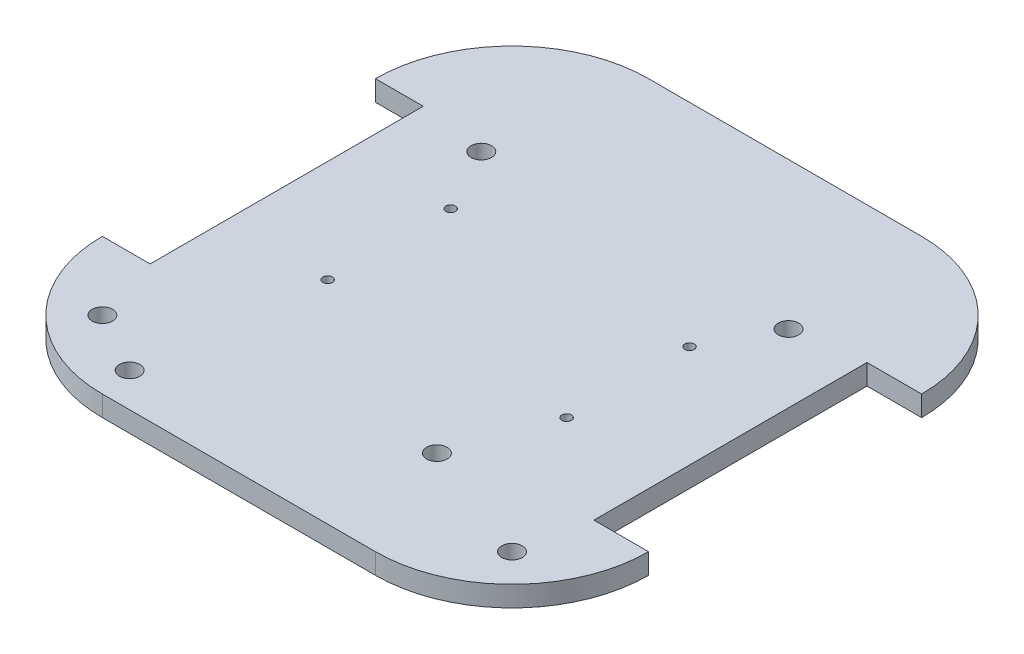
ISO-10303-21;
HEADER;
FILE_DESCRIPTION(('STEP AP214'),'2;1');
FILE_NAME('part.step','',(''),(''),'','','');
FILE_SCHEMA(('AUTOMOTIVE_DESIGN { 1 0 10303 214 1 1 1 1 }'));
ENDSEC;
DATA;
#1=APPLICATION_CONTEXT('core data for automotive mechanical design processes');
#2=APPLICATION_PROTOCOL_DEFINITION('international standard','automotive_design',2000,#1);
#3=PRODUCT_CONTEXT('',#1,'mechanical');
#4=PRODUCT('Part','Part','',(#3));
#5=PRODUCT_RELATED_PRODUCT_CATEGORY('part','',(#4));
#6=PRODUCT_DEFINITION_FORMATION('','',#4);
#7=PRODUCT_DEFINITION_CONTEXT('part definition',#1,'design');
#8=PRODUCT_DEFINITION('design','',#6,#7);
#9=PRODUCT_DEFINITION_SHAPE('','',#8);
#10=(LENGTH_UNIT() NAMED_UNIT(*) SI_UNIT(.MILLI.,.METRE.));
#11=(NAMED_UNIT(*) PLANE_ANGLE_UNIT() SI_UNIT($,.RADIAN.));
#12=(NAMED_UNIT(*) SI_UNIT($,.STERADIAN.) SOLID_ANGLE_UNIT());
#13=UNCERTAINTY_MEASURE_WITH_UNIT(LENGTH_MEASURE(1.E-05),#10,'distance_accuracy_value','');
#14=(GEOMETRIC_REPRESENTATION_CONTEXT(3) GLOBAL_UNCERTAINTY_ASSIGNED_CONTEXT((#13)) GLOBAL_UNIT_ASSIGNED_CONTEXT((#10,
#11,#12)) REPRESENTATION_CONTEXT('',''));
#15=CARTESIAN_POINT('',(0.,0.,0.));
#16=DIRECTION('',(0.,0.,1.));
#17=DIRECTION('',(1.,0.,0.));
#18=AXIS2_PLACEMENT_3D('',#15,#16,#17);
#19=CARTESIAN_POINT('',(20.,3.,-20.));
#20=DIRECTION('',(0.,-1.,0.));
#21=DIRECTION('',(0.,0.,-1.));
#22=AXIS2_PLACEMENT_3D('',#19,#20,#21);
#23=CYLINDRICAL_SURFACE('',#22,20.);
#24=DIRECTION('',(0.,-1.,0.));
#25=VECTOR('',#24,1.);
#26=CARTESIAN_POINT('',(20.,3.,0.));
#27=LINE('',#26,#25);
#28=CARTESIAN_POINT('',(20.,3.,0.));
#29=VERTEX_POINT('',#28);
#30=CARTESIAN_POINT('',(20.,0.,0.));
#31=VERTEX_POINT('',#30);
#32=EDGE_CURVE('E220',#29,#31,#27,.T.);
#33=ORIENTED_EDGE('',*,*,#32,.F.);
#34=CARTESIAN_POINT('',(20.,3.,-20.));
#35=DIRECTION('',(0.,-1.,0.));
#36=DIRECTION('',(0.,0.,-1.));
#37=AXIS2_PLACEMENT_3D('',#34,#35,#36);
#38=CIRCLE('',#37,20.);
#39=CARTESIAN_POINT('',(0.,3.,-20.));
#40=VERTEX_POINT('',#39);
#41=EDGE_CURVE('E40',#40,#29,#38,.F.);
#42=ORIENTED_EDGE('',*,*,#41,.F.);
#43=DIRECTION('',(0.,1.,0.));
#44=VECTOR('',#43,1.);
#45=CARTESIAN_POINT('',(0.,0.,-20.));
#46=LINE('',#45,#44);
#47=CARTESIAN_POINT('',(0.,0.,-20.));
#48=VERTEX_POINT('',#47);
#49=EDGE_CURVE('E173',#48,#40,#46,.T.);
#50=ORIENTED_EDGE('',*,*,#49,.F.);
#51=CARTESIAN_POINT('',(20.,0.,-20.));
#52=DIRECTION('',(0.,-1.,0.));
#53=DIRECTION('',(0.,0.,-1.));
#54=AXIS2_PLACEMENT_3D('',#51,#52,#53);
#55=CIRCLE('',#54,20.);
#56=EDGE_CURVE('E11',#31,#48,#55,.T.);
#57=ORIENTED_EDGE('',*,*,#56,.F.);
#58=EDGE_LOOP('',(#33,#42,#50,#57));
#59=FACE_BOUND('',#58,.T.);
#60=ADVANCED_FACE('F33',(#59),#23,.T.);
#61=CARTESIAN_POINT('',(60.,3.,-20.));
#62=DIRECTION('',(0.,-1.,0.));
#63=DIRECTION('',(0.,0.,-1.));
#64=AXIS2_PLACEMENT_3D('',#61,#62,#63);
#65=CYLINDRICAL_SURFACE('',#64,20.);
#66=DIRECTION('',(0.,1.,0.));
#67=VECTOR('',#66,1.);
#68=CARTESIAN_POINT('',(80.,0.,-20.));
#69=LINE('',#68,#67);
#70=CARTESIAN_POINT('',(80.,0.,-20.));
#71=VERTEX_POINT('',#70);
#72=CARTESIAN_POINT('',(80.,3.,-20.));
#73=VERTEX_POINT('',#72);
#74=EDGE_CURVE('E129',#71,#73,#69,.T.);
#75=ORIENTED_EDGE('',*,*,#74,.T.);
#76=CARTESIAN_POINT('',(60.,3.,-20.));
#77=DIRECTION('',(0.,-1.,0.));
#78=DIRECTION('',(0.,0.,-1.));
#79=AXIS2_PLACEMENT_3D('',#76,#77,#78);
#80=CIRCLE('',#79,20.);
#81=CARTESIAN_POINT('',(60.,3.,0.));
#82=VERTEX_POINT('',#81);
#83=EDGE_CURVE('E216',#82,#73,#80,.F.);
#84=ORIENTED_EDGE('',*,*,#83,.F.);
#85=DIRECTION('',(0.,-1.,0.));
#86=VECTOR('',#85,1.);
#87=CARTESIAN_POINT('',(60.,3.,0.));
#88=LINE('',#87,#86);
#89=CARTESIAN_POINT('',(60.,0.,0.));
#90=VERTEX_POINT('',#89);
#91=EDGE_CURVE('E213',#90,#82,#88,.F.);
#92=ORIENTED_EDGE('',*,*,#91,.F.);
#93=CARTESIAN_POINT('',(60.,0.,-20.));
#94=DIRECTION('',(0.,-1.,0.));
#95=DIRECTION('',(0.,0.,-1.));
#96=AXIS2_PLACEMENT_3D('',#93,#94,#95);
#97=CIRCLE('',#96,20.);
#98=EDGE_CURVE('E218',#71,#90,#97,.T.);
#99=ORIENTED_EDGE('',*,*,#98,.F.);
#100=EDGE_LOOP('',(#75,#84,#92,#99));
#101=FACE_BOUND('',#100,.T.);
#102=ADVANCED_FACE('F228',(#101),#65,.T.);
#103=CARTESIAN_POINT('',(60.,3.,-60.));
#104=DIRECTION('',(0.,1.,0.));
#105=DIRECTION('',(0.,0.,1.));
#106=AXIS2_PLACEMENT_3D('',#103,#104,#105);
#107=CYLINDRICAL_SURFACE('',#106,20.);
#108=DIRECTION('',(0.,1.,0.));
#109=VECTOR('',#108,1.);
#110=CARTESIAN_POINT('',(80.,0.,-60.));
#111=LINE('',#110,#109);
#112=CARTESIAN_POINT('',(80.,0.,-60.));
#113=VERTEX_POINT('',#112);
#114=CARTESIAN_POINT('',(80.,3.,-60.));
#115=VERTEX_POINT('',#114);
#116=EDGE_CURVE('E159',#113,#115,#111,.T.);
#117=ORIENTED_EDGE('',*,*,#116,.F.);
#118=CARTESIAN_POINT('',(60.,0.,-60.));
#119=DIRECTION('',(0.,-1.,0.));
#120=DIRECTION('',(0.,0.,-1.));
#121=AXIS2_PLACEMENT_3D('',#118,#119,#120);
#122=CIRCLE('',#121,20.);
#123=CARTESIAN_POINT('',(60.,0.,-80.));
#124=VERTEX_POINT('',#123);
#125=EDGE_CURVE('E209',#124,#113,#122,.T.);
#126=ORIENTED_EDGE('',*,*,#125,.F.);
#127=DIRECTION('',(0.,1.,0.));
#128=VECTOR('',#127,1.);
#129=CARTESIAN_POINT('',(60.,3.,-80.));
#130=LINE('',#129,#128);
#131=CARTESIAN_POINT('',(60.,3.,-80.));
#132=VERTEX_POINT('',#131);
#133=EDGE_CURVE('E206',#132,#124,#130,.F.);
#134=ORIENTED_EDGE('',*,*,#133,.F.);
#135=CARTESIAN_POINT('',(60.,3.,-60.));
#136=DIRECTION('',(0.,-1.,0.));
#137=DIRECTION('',(0.,0.,-1.));
#138=AXIS2_PLACEMENT_3D('',#135,#136,#137);
#139=CIRCLE('',#138,20.);
#140=EDGE_CURVE('E211',#115,#132,#139,.F.);
#141=ORIENTED_EDGE('',*,*,#140,.F.);
#142=EDGE_LOOP('',(#117,#126,#134,#141));
#143=FACE_BOUND('',#142,.T.);
#144=ADVANCED_FACE('F236',(#143),#107,.T.);
#145=CARTESIAN_POINT('',(20.,3.,-60.));
#146=DIRECTION('',(0.,-1.,0.));
#147=DIRECTION('',(0.,0.,-1.));
#148=AXIS2_PLACEMENT_3D('',#145,#146,#147);
#149=CYLINDRICAL_SURFACE('',#148,20.);
#150=DIRECTION('',(0.,1.,0.));
#151=VECTOR('',#150,1.);
#152=CARTESIAN_POINT('',(0.,0.,-60.));
#153=LINE('',#152,#151);
#154=CARTESIAN_POINT('',(0.,0.,-60.));
#155=VERTEX_POINT('',#154);
#156=CARTESIAN_POINT('',(0.,3.,-60.));
#157=VERTEX_POINT('',#156);
#158=EDGE_CURVE('E181',#155,#157,#153,.T.);
#159=ORIENTED_EDGE('',*,*,#158,.T.);
#160=CARTESIAN_POINT('',(20.,3.,-60.));
#161=DIRECTION('',(0.,-1.,0.));
#162=DIRECTION('',(0.,0.,-1.));
#163=AXIS2_PLACEMENT_3D('',#160,#161,#162);
#164=CIRCLE('',#163,20.);
#165=CARTESIAN_POINT('',(20.,3.,-80.));
#166=VERTEX_POINT('',#165);
#167=EDGE_CURVE('E201',#166,#157,#164,.F.);
#168=ORIENTED_EDGE('',*,*,#167,.F.);
#169=DIRECTION('',(0.,-1.,0.));
#170=VECTOR('',#169,1.);
#171=CARTESIAN_POINT('',(20.,3.,-80.));
#172=LINE('',#171,#170);
#173=CARTESIAN_POINT('',(20.,0.,-80.));
#174=VERTEX_POINT('',#173);
#175=EDGE_CURVE('E196',#174,#166,#172,.F.);
#176=ORIENTED_EDGE('',*,*,#175,.F.);
#177=CARTESIAN_POINT('',(20.,0.,-60.));
#178=DIRECTION('',(0.,-1.,0.));
#179=DIRECTION('',(0.,0.,-1.));
#180=AXIS2_PLACEMENT_3D('',#177,#178,#179);
#181=CIRCLE('',#180,20.);
#182=EDGE_CURVE('E203',#155,#174,#181,.T.);
#183=ORIENTED_EDGE('',*,*,#182,.F.);
#184=EDGE_LOOP('',(#159,#168,#176,#183));
#185=FACE_BOUND('',#184,.T.);
#186=ADVANCED_FACE('F245',(#185),#149,.T.);
#187=CARTESIAN_POINT('',(0.,3.,0.));
#188=DIRECTION('',(0.,0.,-1.));
#189=DIRECTION('',(-1.,0.,0.));
#190=AXIS2_PLACEMENT_3D('',#187,#188,#189);
#191=PLANE('',#190);
#192=DIRECTION('',(1.,0.,0.));
#193=VECTOR('',#192,1.);
#194=CARTESIAN_POINT('',(0.,3.,0.));
#195=LINE('',#194,#193);
#196=EDGE_CURVE('E191',#29,#82,#195,.T.);
#197=ORIENTED_EDGE('',*,*,#196,.F.);
#198=ORIENTED_EDGE('',*,*,#32,.T.);
#199=DIRECTION('',(1.,0.,0.));
#200=VECTOR('',#199,1.);
#201=CARTESIAN_POINT('',(0.,0.,0.));
#202=LINE('',#201,#200);
#203=EDGE_CURVE('E184',#31,#90,#202,.T.);
#204=ORIENTED_EDGE('',*,*,#203,.T.);
#205=ORIENTED_EDGE('',*,*,#91,.T.);
#206=EDGE_LOOP('',(#197,#198,#204,#205));
#207=FACE_BOUND('',#206,.T.);
#208=ADVANCED_FACE('F223',(#207),#191,.F.);
#209=CARTESIAN_POINT('',(0.,3.,-80.));
#210=DIRECTION('',(0.,0.,1.));
#211=DIRECTION('',(1.,0.,0.));
#212=AXIS2_PLACEMENT_3D('',#209,#210,#211);
#213=PLANE('',#212);
#214=DIRECTION('',(-1.,0.,0.));
#215=VECTOR('',#214,1.);
#216=CARTESIAN_POINT('',(0.,3.,-80.));
#217=LINE('',#216,#215);
#218=EDGE_CURVE('E193',#132,#166,#217,.T.);
#219=ORIENTED_EDGE('',*,*,#218,.F.);
#220=ORIENTED_EDGE('',*,*,#133,.T.);
#221=DIRECTION('',(-1.,0.,0.));
#222=VECTOR('',#221,1.);
#223=CARTESIAN_POINT('',(0.,0.,-80.));
#224=LINE('',#223,#222);
#225=EDGE_CURVE('E194',#124,#174,#224,.T.);
#226=ORIENTED_EDGE('',*,*,#225,.T.);
#227=ORIENTED_EDGE('',*,*,#175,.T.);
#228=EDGE_LOOP('',(#219,#220,#226,#227));
#229=FACE_BOUND('',#228,.T.);
#230=ADVANCED_FACE('F240',(#229),#213,.F.);
#231=CARTESIAN_POINT('',(0.,3.,0.));
#232=DIRECTION('',(0.,-1.,0.));
#233=DIRECTION('',(0.,0.,-1.));
#234=AXIS2_PLACEMENT_3D('',#231,#232,#233);
#235=PLANE('',#234);
#236=CARTESIAN_POINT('',(57.,3.,-31.));
#237=DIRECTION('',(0.,1.,0.));
#238=DIRECTION('',(0.,0.,1.));
#239=AXIS2_PLACEMENT_3D('',#236,#237,#238);
#240=CIRCLE('',#239,0.700000000000001);
#241=CARTESIAN_POINT('',(57.,3.,-30.3));
#242=VERTEX_POINT('',#241);
#243=EDGE_CURVE('E336',#242,#242,#240,.T.);
#244=ORIENTED_EDGE('',*,*,#243,.F.);
#245=EDGE_LOOP('',(#244));
#246=FACE_BOUND('',#245,.T.);
#247=CARTESIAN_POINT('',(57.,3.,-49.));
#248=DIRECTION('',(0.,1.,0.));
#249=DIRECTION('',(0.,0.,1.));
#250=AXIS2_PLACEMENT_3D('',#247,#248,#249);
#251=CIRCLE('',#250,0.700000000000001);
#252=CARTESIAN_POINT('',(57.,3.,-48.3));
#253=VERTEX_POINT('',#252);
#254=EDGE_CURVE('E338',#253,#253,#251,.T.);
#255=ORIENTED_EDGE('',*,*,#254,.F.);
#256=EDGE_LOOP('',(#255));
#257=FACE_BOUND('',#256,.T.);
#258=CARTESIAN_POINT('',(22.,3.,-31.));
#259=DIRECTION('',(0.,1.,0.));
#260=DIRECTION('',(0.,0.,1.));
#261=AXIS2_PLACEMENT_3D('',#258,#259,#260);
#262=CIRCLE('',#261,0.699999999999998);
#263=CARTESIAN_POINT('',(22.,3.,-30.3));
#264=VERTEX_POINT('',#263);
#265=EDGE_CURVE('E344',#264,#264,#262,.T.);
#266=ORIENTED_EDGE('',*,*,#265,.F.);
#267=EDGE_LOOP('',(#266));
#268=FACE_BOUND('',#267,.T.);
#269=CARTESIAN_POINT('',(22.,3.,-49.));
#270=DIRECTION('',(0.,1.,0.));
#271=DIRECTION('',(0.,0.,1.));
#272=AXIS2_PLACEMENT_3D('',#269,#270,#271);
#273=CIRCLE('',#272,0.699999999999998);
#274=CARTESIAN_POINT('',(22.,3.,-48.3));
#275=VERTEX_POINT('',#274);
#276=EDGE_CURVE('E350',#275,#275,#273,.T.);
#277=ORIENTED_EDGE('',*,*,#276,.F.);
#278=EDGE_LOOP('',(#277));
#279=FACE_BOUND('',#278,.T.);
#280=CARTESIAN_POINT('',(52.,3.,-17.));
#281=DIRECTION('',(0.,1.,0.));
#282=DIRECTION('',(0.,0.,1.));
#283=AXIS2_PLACEMENT_3D('',#280,#281,#282);
#284=CIRCLE('',#283,1.5);
#285=CARTESIAN_POINT('',(52.,3.,-15.5));
#286=VERTEX_POINT('',#285);
#287=EDGE_CURVE('E356',#286,#286,#284,.T.);
#288=ORIENTED_EDGE('',*,*,#287,.F.);
#289=EDGE_LOOP('',(#288));
#290=FACE_BOUND('',#289,.T.);
#291=CARTESIAN_POINT('',(19.,3.,-5.));
#292=DIRECTION('',(0.,1.,0.));
#293=DIRECTION('',(0.,0.,1.));
#294=AXIS2_PLACEMENT_3D('',#291,#292,#293);
#295=CIRCLE('',#294,1.5);
#296=CARTESIAN_POINT('',(19.,3.,-3.5));
#297=VERTEX_POINT('',#296);
#298=EDGE_CURVE('E362',#297,#297,#295,.T.);
#299=ORIENTED_EDGE('',*,*,#298,.F.);
#300=EDGE_LOOP('',(#299));
#301=FACE_BOUND('',#300,.T.);
#302=CARTESIAN_POINT('',(10.,3.,-10.));
#303=DIRECTION('',(0.,1.,0.));
#304=DIRECTION('',(0.,0.,1.));
#305=AXIS2_PLACEMENT_3D('',#302,#303,#304);
#306=CIRCLE('',#305,1.5);
#307=CARTESIAN_POINT('',(10.,3.,-8.49999999999999));
#308=VERTEX_POINT('',#307);
#309=EDGE_CURVE('E368',#308,#308,#306,.T.);
#310=ORIENTED_EDGE('',*,*,#309,.F.);
#311=EDGE_LOOP('',(#310));
#312=FACE_BOUND('',#311,.T.);
#313=CARTESIAN_POINT('',(70.,3.,-9.99999999999999));
#314=DIRECTION('',(0.,1.,0.));
#315=DIRECTION('',(0.,0.,1.));
#316=AXIS2_PLACEMENT_3D('',#313,#314,#315);
#317=CIRCLE('',#316,1.5);
#318=CARTESIAN_POINT('',(70.,3.,-8.5));
#319=VERTEX_POINT('',#318);
#320=EDGE_CURVE('E374',#319,#319,#317,.T.);
#321=ORIENTED_EDGE('',*,*,#320,.F.);
#322=EDGE_LOOP('',(#321));
#323=FACE_BOUND('',#322,.T.);
#324=CARTESIAN_POINT('',(62.,3.,-58.5));
#325=DIRECTION('',(0.,1.,0.));
#326=DIRECTION('',(0.,0.,1.));
#327=AXIS2_PLACEMENT_3D('',#324,#325,#326);
#328=CIRCLE('',#327,1.5);
#329=CARTESIAN_POINT('',(62.,3.,-57.));
#330=VERTEX_POINT('',#329);
#331=EDGE_CURVE('E380',#330,#330,#328,.T.);
#332=ORIENTED_EDGE('',*,*,#331,.F.);
#333=EDGE_LOOP('',(#332));
#334=FACE_BOUND('',#333,.T.);
#335=CARTESIAN_POINT('',(17.,3.,-58.5));
#336=DIRECTION('',(0.,1.,0.));
#337=DIRECTION('',(0.,0.,1.));
#338=AXIS2_PLACEMENT_3D('',#335,#336,#337);
#339=CIRCLE('',#338,1.5);
#340=CARTESIAN_POINT('',(17.,3.,-57.));
#341=VERTEX_POINT('',#340);
#342=EDGE_CURVE('E149',#341,#341,#339,.T.);
#343=ORIENTED_EDGE('',*,*,#342,.F.);
#344=EDGE_LOOP('',(#343));
#345=FACE_BOUND('',#344,.T.);
#346=DIRECTION('',(1.,0.,0.));
#347=VECTOR('',#346,1.);
#348=CARTESIAN_POINT('',(0.,3.,-20.));
#349=LINE('',#348,#347);
#350=CARTESIAN_POINT('',(7.00000000000001,3.,-20.));
#351=VERTEX_POINT('',#350);
#352=EDGE_CURVE('E158',#40,#351,#349,.T.);
#353=ORIENTED_EDGE('',*,*,#352,.F.);
#354=ORIENTED_EDGE('',*,*,#41,.T.);
#355=ORIENTED_EDGE('',*,*,#196,.T.);
#356=ORIENTED_EDGE('',*,*,#83,.T.);
#357=DIRECTION('',(1.,0.,0.));
#358=VECTOR('',#357,1.);
#359=CARTESIAN_POINT('',(72.,3.,-20.));
#360=LINE('',#359,#358);
#361=CARTESIAN_POINT('',(72.,3.,-20.));
#362=VERTEX_POINT('',#361);
#363=EDGE_CURVE('E146',#362,#73,#360,.T.);
#364=ORIENTED_EDGE('',*,*,#363,.F.);
#365=DIRECTION('',(0.,0.,1.));
#366=VECTOR('',#365,1.);
#367=CARTESIAN_POINT('',(72.,3.,-60.));
#368=LINE('',#367,#366);
#369=CARTESIAN_POINT('',(72.,3.,-60.));
#370=VERTEX_POINT('',#369);
#371=EDGE_CURVE('E125',#370,#362,#368,.T.);
#372=ORIENTED_EDGE('',*,*,#371,.F.);
#373=DIRECTION('',(-1.,0.,0.));
#374=VECTOR('',#373,1.);
#375=CARTESIAN_POINT('',(72.,3.,-60.));
#376=LINE('',#375,#374);
#377=EDGE_CURVE('E143',#115,#370,#376,.T.);
#378=ORIENTED_EDGE('',*,*,#377,.F.);
#379=ORIENTED_EDGE('',*,*,#140,.T.);
#380=ORIENTED_EDGE('',*,*,#218,.T.);
#381=ORIENTED_EDGE('',*,*,#167,.T.);
#382=DIRECTION('',(-1.,0.,0.));
#383=VECTOR('',#382,1.);
#384=CARTESIAN_POINT('',(0.,3.,-60.));
#385=LINE('',#384,#383);
#386=CARTESIAN_POINT('',(7.,3.,-60.));
#387=VERTEX_POINT('',#386);
#388=EDGE_CURVE('E167',#387,#157,#385,.T.);
#389=ORIENTED_EDGE('',*,*,#388,.F.);
#390=DIRECTION('',(0.,0.,-1.));
#391=VECTOR('',#390,1.);
#392=CARTESIAN_POINT('',(7.,3.,-60.));
#393=LINE('',#392,#391);
#394=EDGE_CURVE('E176',#351,#387,#393,.T.);
#395=ORIENTED_EDGE('',*,*,#394,.F.);
#396=EDGE_LOOP('',(#353,#354,#355,#356,#364,#372,#378,#379,#380,#381,#389,#395));
#397=FACE_BOUND('',#396,.T.);
#398=ADVANCED_FACE('F229',(#246,#257,#268,#279,#290,#301,#312,#323,#334,#345,#397),#235,.F.);
#399=CARTESIAN_POINT('',(0.,0.,0.));
#400=DIRECTION('',(0.,-1.,0.));
#401=DIRECTION('',(0.,0.,-1.));
#402=AXIS2_PLACEMENT_3D('',#399,#400,#401);
#403=PLANE('',#402);
#404=CARTESIAN_POINT('',(57.,0.,-31.));
#405=DIRECTION('',(0.,1.,0.));
#406=DIRECTION('',(0.,0.,1.));
#407=AXIS2_PLACEMENT_3D('',#404,#405,#406);
#408=CIRCLE('',#407,0.700000000000001);
#409=CARTESIAN_POINT('',(57.,0.,-30.3));
#410=VERTEX_POINT('',#409);
#411=EDGE_CURVE('E333',#410,#410,#408,.T.);
#412=ORIENTED_EDGE('',*,*,#411,.T.);
#413=EDGE_LOOP('',(#412));
#414=FACE_BOUND('',#413,.T.);
#415=CARTESIAN_POINT('',(57.,0.,-49.));
#416=DIRECTION('',(0.,1.,0.));
#417=DIRECTION('',(0.,0.,1.));
#418=AXIS2_PLACEMENT_3D('',#415,#416,#417);
#419=CIRCLE('',#418,0.700000000000001);
#420=CARTESIAN_POINT('',(57.,0.,-48.3));
#421=VERTEX_POINT('',#420);
#422=EDGE_CURVE('E341',#421,#421,#419,.T.);
#423=ORIENTED_EDGE('',*,*,#422,.T.);
#424=EDGE_LOOP('',(#423));
#425=FACE_BOUND('',#424,.T.);
#426=CARTESIAN_POINT('',(22.,0.,-31.));
#427=DIRECTION('',(0.,1.,0.));
#428=DIRECTION('',(0.,0.,1.));
#429=AXIS2_PLACEMENT_3D('',#426,#427,#428);
#430=CIRCLE('',#429,0.699999999999998);
#431=CARTESIAN_POINT('',(22.,0.,-30.3));
#432=VERTEX_POINT('',#431);
#433=EDGE_CURVE('E347',#432,#432,#430,.T.);
#434=ORIENTED_EDGE('',*,*,#433,.T.);
#435=EDGE_LOOP('',(#434));
#436=FACE_BOUND('',#435,.T.);
#437=CARTESIAN_POINT('',(22.,0.,-49.));
#438=DIRECTION('',(0.,1.,0.));
#439=DIRECTION('',(0.,0.,1.));
#440=AXIS2_PLACEMENT_3D('',#437,#438,#439);
#441=CIRCLE('',#440,0.699999999999998);
#442=CARTESIAN_POINT('',(22.,0.,-48.3));
#443=VERTEX_POINT('',#442);
#444=EDGE_CURVE('E353',#443,#443,#441,.T.);
#445=ORIENTED_EDGE('',*,*,#444,.T.);
#446=EDGE_LOOP('',(#445));
#447=FACE_BOUND('',#446,.T.);
#448=CARTESIAN_POINT('',(52.,0.,-17.));
#449=DIRECTION('',(0.,1.,0.));
#450=DIRECTION('',(0.,0.,1.));
#451=AXIS2_PLACEMENT_3D('',#448,#449,#450);
#452=CIRCLE('',#451,1.5);
#453=CARTESIAN_POINT('',(52.,0.,-15.5));
#454=VERTEX_POINT('',#453);
#455=EDGE_CURVE('E359',#454,#454,#452,.T.);
#456=ORIENTED_EDGE('',*,*,#455,.T.);
#457=EDGE_LOOP('',(#456));
#458=FACE_BOUND('',#457,.T.);
#459=CARTESIAN_POINT('',(19.,0.,-5.));
#460=DIRECTION('',(0.,1.,0.));
#461=DIRECTION('',(0.,0.,1.));
#462=AXIS2_PLACEMENT_3D('',#459,#460,#461);
#463=CIRCLE('',#462,1.5);
#464=CARTESIAN_POINT('',(19.,0.,-3.5));
#465=VERTEX_POINT('',#464);
#466=EDGE_CURVE('E365',#465,#465,#463,.T.);
#467=ORIENTED_EDGE('',*,*,#466,.T.);
#468=EDGE_LOOP('',(#467));
#469=FACE_BOUND('',#468,.T.);
#470=CARTESIAN_POINT('',(10.,0.,-10.));
#471=DIRECTION('',(0.,1.,0.));
#472=DIRECTION('',(0.,0.,1.));
#473=AXIS2_PLACEMENT_3D('',#470,#471,#472);
#474=CIRCLE('',#473,1.5);
#475=CARTESIAN_POINT('',(10.,0.,-8.49999999999999));
#476=VERTEX_POINT('',#475);
#477=EDGE_CURVE('E371',#476,#476,#474,.T.);
#478=ORIENTED_EDGE('',*,*,#477,.T.);
#479=EDGE_LOOP('',(#478));
#480=FACE_BOUND('',#479,.T.);
#481=CARTESIAN_POINT('',(70.,0.,-9.99999999999999));
#482=DIRECTION('',(0.,1.,0.));
#483=DIRECTION('',(0.,0.,1.));
#484=AXIS2_PLACEMENT_3D('',#481,#482,#483);
#485=CIRCLE('',#484,1.5);
#486=CARTESIAN_POINT('',(70.,0.,-8.5));
#487=VERTEX_POINT('',#486);
#488=EDGE_CURVE('E377',#487,#487,#485,.T.);
#489=ORIENTED_EDGE('',*,*,#488,.T.);
#490=EDGE_LOOP('',(#489));
#491=FACE_BOUND('',#490,.T.);
#492=CARTESIAN_POINT('',(62.,0.,-58.5));
#493=DIRECTION('',(0.,1.,0.));
#494=DIRECTION('',(0.,0.,1.));
#495=AXIS2_PLACEMENT_3D('',#492,#493,#494);
#496=CIRCLE('',#495,1.5);
#497=CARTESIAN_POINT('',(62.,0.,-57.));
#498=VERTEX_POINT('',#497);
#499=EDGE_CURVE('E383',#498,#498,#496,.T.);
#500=ORIENTED_EDGE('',*,*,#499,.T.);
#501=EDGE_LOOP('',(#500));
#502=FACE_BOUND('',#501,.T.);
#503=CARTESIAN_POINT('',(17.,0.,-58.5));
#504=DIRECTION('',(0.,1.,0.));
#505=DIRECTION('',(0.,0.,1.));
#506=AXIS2_PLACEMENT_3D('',#503,#504,#505);
#507=CIRCLE('',#506,1.5);
#508=CARTESIAN_POINT('',(17.,0.,-57.));
#509=VERTEX_POINT('',#508);
#510=EDGE_CURVE('E154',#509,#509,#507,.T.);
#511=ORIENTED_EDGE('',*,*,#510,.T.);
#512=EDGE_LOOP('',(#511));
#513=FACE_BOUND('',#512,.T.);
#514=ORIENTED_EDGE('',*,*,#203,.F.);
#515=ORIENTED_EDGE('',*,*,#56,.T.);
#516=DIRECTION('',(1.,0.,0.));
#517=VECTOR('',#516,1.);
#518=CARTESIAN_POINT('',(0.,0.,-20.));
#519=LINE('',#518,#517);
#520=CARTESIAN_POINT('',(7.00000000000001,0.,-20.));
#521=VERTEX_POINT('',#520);
#522=EDGE_CURVE('E163',#48,#521,#519,.T.);
#523=ORIENTED_EDGE('',*,*,#522,.T.);
#524=DIRECTION('',(0.,0.,-1.));
#525=VECTOR('',#524,1.);
#526=CARTESIAN_POINT('',(7.,0.,-60.));
#527=LINE('',#526,#525);
#528=CARTESIAN_POINT('',(7.,0.,-60.));
#529=VERTEX_POINT('',#528);
#530=EDGE_CURVE('E166',#521,#529,#527,.T.);
#531=ORIENTED_EDGE('',*,*,#530,.T.);
#532=DIRECTION('',(-1.,0.,0.));
#533=VECTOR('',#532,1.);
#534=CARTESIAN_POINT('',(0.,0.,-60.));
#535=LINE('',#534,#533);
#536=EDGE_CURVE('E170',#529,#155,#535,.T.);
#537=ORIENTED_EDGE('',*,*,#536,.T.);
#538=ORIENTED_EDGE('',*,*,#182,.T.);
#539=ORIENTED_EDGE('',*,*,#225,.F.);
#540=ORIENTED_EDGE('',*,*,#125,.T.);
#541=DIRECTION('',(-1.,0.,0.));
#542=VECTOR('',#541,1.);
#543=CARTESIAN_POINT('',(72.,0.,-60.));
#544=LINE('',#543,#542);
#545=CARTESIAN_POINT('',(72.,0.,-60.));
#546=VERTEX_POINT('',#545);
#547=EDGE_CURVE('E130',#113,#546,#544,.T.);
#548=ORIENTED_EDGE('',*,*,#547,.T.);
#549=DIRECTION('',(0.,0.,1.));
#550=VECTOR('',#549,1.);
#551=CARTESIAN_POINT('',(72.,0.,-60.));
#552=LINE('',#551,#550);
#553=CARTESIAN_POINT('',(72.,0.,-20.));
#554=VERTEX_POINT('',#553);
#555=EDGE_CURVE('E122',#546,#554,#552,.T.);
#556=ORIENTED_EDGE('',*,*,#555,.T.);
#557=DIRECTION('',(1.,0.,0.));
#558=VECTOR('',#557,1.);
#559=CARTESIAN_POINT('',(72.,0.,-20.));
#560=LINE('',#559,#558);
#561=EDGE_CURVE('E134',#554,#71,#560,.T.);
#562=ORIENTED_EDGE('',*,*,#561,.T.);
#563=ORIENTED_EDGE('',*,*,#98,.T.);
#564=EDGE_LOOP('',(#514,#515,#523,#531,#537,#538,#539,#540,#548,#556,#562,#563));
#565=FACE_BOUND('',#564,.T.);
#566=ADVANCED_FACE('F141',(#414,#425,#436,#447,#458,#469,#480,#491,#502,#513,#565),#403,.T.);
#567=CARTESIAN_POINT('',(0.,0.,-60.));
#568=DIRECTION('',(0.,0.,-1.));
#569=DIRECTION('',(-1.,0.,0.));
#570=AXIS2_PLACEMENT_3D('',#567,#568,#569);
#571=PLANE('',#570);
#572=ORIENTED_EDGE('',*,*,#388,.T.);
#573=ORIENTED_EDGE('',*,*,#158,.F.);
#574=ORIENTED_EDGE('',*,*,#536,.F.);
#575=DIRECTION('',(0.,1.,0.));
#576=VECTOR('',#575,1.);
#577=CARTESIAN_POINT('',(7.,0.,-60.));
#578=LINE('',#577,#576);
#579=EDGE_CURVE('E185',#529,#387,#578,.T.);
#580=ORIENTED_EDGE('',*,*,#579,.T.);
#581=EDGE_LOOP('',(#572,#573,#574,#580));
#582=FACE_BOUND('',#581,.T.);
#583=ADVANCED_FACE('F249',(#582),#571,.F.);
#584=CARTESIAN_POINT('',(7.,0.,-60.));
#585=DIRECTION('',(1.,0.,0.));
#586=DIRECTION('',(0.,0.,-1.));
#587=AXIS2_PLACEMENT_3D('',#584,#585,#586);
#588=PLANE('',#587);
#589=ORIENTED_EDGE('',*,*,#394,.T.);
#590=ORIENTED_EDGE('',*,*,#579,.F.);
#591=ORIENTED_EDGE('',*,*,#530,.F.);
#592=DIRECTION('',(0.,1.,0.));
#593=VECTOR('',#592,1.);
#594=CARTESIAN_POINT('',(7.00000000000001,0.,-20.));
#595=LINE('',#594,#593);
#596=EDGE_CURVE('E187',#521,#351,#595,.T.);
#597=ORIENTED_EDGE('',*,*,#596,.T.);
#598=EDGE_LOOP('',(#589,#590,#591,#597));
#599=FACE_BOUND('',#598,.T.);
#600=ADVANCED_FACE('F252',(#599),#588,.F.);
#601=CARTESIAN_POINT('',(0.,0.,-20.));
#602=DIRECTION('',(0.,0.,1.));
#603=DIRECTION('',(1.,0.,0.));
#604=AXIS2_PLACEMENT_3D('',#601,#602,#603);
#605=PLANE('',#604);
#606=ORIENTED_EDGE('',*,*,#352,.T.);
#607=ORIENTED_EDGE('',*,*,#596,.F.);
#608=ORIENTED_EDGE('',*,*,#522,.F.);
#609=ORIENTED_EDGE('',*,*,#49,.T.);
#610=EDGE_LOOP('',(#606,#607,#608,#609));
#611=FACE_BOUND('',#610,.T.);
#612=ADVANCED_FACE('F254',(#611),#605,.F.);
#613=CARTESIAN_POINT('',(72.,0.,-60.));
#614=DIRECTION('',(-1.,0.,0.));
#615=DIRECTION('',(0.,0.,1.));
#616=AXIS2_PLACEMENT_3D('',#613,#614,#615);
#617=PLANE('',#616);
#618=ORIENTED_EDGE('',*,*,#371,.T.);
#619=DIRECTION('',(0.,1.,0.));
#620=VECTOR('',#619,1.);
#621=CARTESIAN_POINT('',(72.,0.,-20.));
#622=LINE('',#621,#620);
#623=EDGE_CURVE('E118',#554,#362,#622,.T.);
#624=ORIENTED_EDGE('',*,*,#623,.F.);
#625=ORIENTED_EDGE('',*,*,#555,.F.);
#626=DIRECTION('',(0.,1.,0.));
#627=VECTOR('',#626,1.);
#628=CARTESIAN_POINT('',(72.,0.,-60.));
#629=LINE('',#628,#627);
#630=EDGE_CURVE('E156',#546,#370,#629,.T.);
#631=ORIENTED_EDGE('',*,*,#630,.T.);
#632=EDGE_LOOP('',(#618,#624,#625,#631));
#633=FACE_BOUND('',#632,.T.);
#634=ADVANCED_FACE('F120',(#633),#617,.F.);
#635=CARTESIAN_POINT('',(72.,0.,-60.));
#636=DIRECTION('',(0.,0.,-1.));
#637=DIRECTION('',(-1.,0.,0.));
#638=AXIS2_PLACEMENT_3D('',#635,#636,#637);
#639=PLANE('',#638);
#640=ORIENTED_EDGE('',*,*,#377,.T.);
#641=ORIENTED_EDGE('',*,*,#630,.F.);
#642=ORIENTED_EDGE('',*,*,#547,.F.);
#643=ORIENTED_EDGE('',*,*,#116,.T.);
#644=EDGE_LOOP('',(#640,#641,#642,#643));
#645=FACE_BOUND('',#644,.T.);
#646=ADVANCED_FACE('F233',(#645),#639,.F.);
#647=CARTESIAN_POINT('',(72.,0.,-20.));
#648=DIRECTION('',(0.,0.,1.));
#649=DIRECTION('',(1.,0.,0.));
#650=AXIS2_PLACEMENT_3D('',#647,#648,#649);
#651=PLANE('',#650);
#652=ORIENTED_EDGE('',*,*,#363,.T.);
#653=ORIENTED_EDGE('',*,*,#74,.F.);
#654=ORIENTED_EDGE('',*,*,#561,.F.);
#655=ORIENTED_EDGE('',*,*,#623,.T.);
#656=EDGE_LOOP('',(#652,#653,#654,#655));
#657=FACE_BOUND('',#656,.T.);
#658=ADVANCED_FACE('F135',(#657),#651,.F.);
#659=CARTESIAN_POINT('',(17.,0.,-58.5));
#660=DIRECTION('',(0.,1.,0.));
#661=DIRECTION('',(0.,0.,1.));
#662=AXIS2_PLACEMENT_3D('',#659,#660,#661);
#663=CYLINDRICAL_SURFACE('',#662,1.5);
#664=ORIENTED_EDGE('',*,*,#510,.F.);
#665=EDGE_LOOP('',(#664));
#666=FACE_BOUND('',#665,.T.);
#667=ORIENTED_EDGE('',*,*,#342,.T.);
#668=EDGE_LOOP('',(#667));
#669=FACE_BOUND('',#668,.T.);
#670=ADVANCED_FACE('F287',(#666,#669),#663,.F.);
#671=CARTESIAN_POINT('',(62.,0.,-58.5));
#672=DIRECTION('',(0.,1.,0.));
#673=DIRECTION('',(0.,0.,1.));
#674=AXIS2_PLACEMENT_3D('',#671,#672,#673);
#675=CYLINDRICAL_SURFACE('',#674,1.5);
#676=ORIENTED_EDGE('',*,*,#499,.F.);
#677=EDGE_LOOP('',(#676));
#678=FACE_BOUND('',#677,.T.);
#679=ORIENTED_EDGE('',*,*,#331,.T.);
#680=EDGE_LOOP('',(#679));
#681=FACE_BOUND('',#680,.T.);
#682=ADVANCED_FACE('F292',(#678,#681),#675,.F.);
#683=CARTESIAN_POINT('',(70.,0.,-9.99999999999999));
#684=DIRECTION('',(0.,1.,0.));
#685=DIRECTION('',(0.,0.,1.));
#686=AXIS2_PLACEMENT_3D('',#683,#684,#685);
#687=CYLINDRICAL_SURFACE('',#686,1.5);
#688=ORIENTED_EDGE('',*,*,#488,.F.);
#689=EDGE_LOOP('',(#688));
#690=FACE_BOUND('',#689,.T.);
#691=ORIENTED_EDGE('',*,*,#320,.T.);
#692=EDGE_LOOP('',(#691));
#693=FACE_BOUND('',#692,.T.);
#694=ADVANCED_FACE('F296',(#690,#693),#687,.F.);
#695=CARTESIAN_POINT('',(10.,0.,-10.));
#696=DIRECTION('',(0.,1.,0.));
#697=DIRECTION('',(0.,0.,1.));
#698=AXIS2_PLACEMENT_3D('',#695,#696,#697);
#699=CYLINDRICAL_SURFACE('',#698,1.5);
#700=ORIENTED_EDGE('',*,*,#477,.F.);
#701=EDGE_LOOP('',(#700));
#702=FACE_BOUND('',#701,.T.);
#703=ORIENTED_EDGE('',*,*,#309,.T.);
#704=EDGE_LOOP('',(#703));
#705=FACE_BOUND('',#704,.T.);
#706=ADVANCED_FACE('F300',(#702,#705),#699,.F.);
#707=CARTESIAN_POINT('',(19.,0.,-5.));
#708=DIRECTION('',(0.,1.,0.));
#709=DIRECTION('',(0.,0.,1.));
#710=AXIS2_PLACEMENT_3D('',#707,#708,#709);
#711=CYLINDRICAL_SURFACE('',#710,1.5);
#712=ORIENTED_EDGE('',*,*,#466,.F.);
#713=EDGE_LOOP('',(#712));
#714=FACE_BOUND('',#713,.T.);
#715=ORIENTED_EDGE('',*,*,#298,.T.);
#716=EDGE_LOOP('',(#715));
#717=FACE_BOUND('',#716,.T.);
#718=ADVANCED_FACE('F304',(#714,#717),#711,.F.);
#719=CARTESIAN_POINT('',(52.,0.,-17.));
#720=DIRECTION('',(0.,1.,0.));
#721=DIRECTION('',(0.,0.,1.));
#722=AXIS2_PLACEMENT_3D('',#719,#720,#721);
#723=CYLINDRICAL_SURFACE('',#722,1.5);
#724=ORIENTED_EDGE('',*,*,#455,.F.);
#725=EDGE_LOOP('',(#724));
#726=FACE_BOUND('',#725,.T.);
#727=ORIENTED_EDGE('',*,*,#287,.T.);
#728=EDGE_LOOP('',(#727));
#729=FACE_BOUND('',#728,.T.);
#730=ADVANCED_FACE('F308',(#726,#729),#723,.F.);
#731=CARTESIAN_POINT('',(22.,0.,-49.));
#732=DIRECTION('',(0.,1.,0.));
#733=DIRECTION('',(0.,0.,1.));
#734=AXIS2_PLACEMENT_3D('',#731,#732,#733);
#735=CYLINDRICAL_SURFACE('',#734,0.699999999999998);
#736=ORIENTED_EDGE('',*,*,#444,.F.);
#737=EDGE_LOOP('',(#736));
#738=FACE_BOUND('',#737,.T.);
#739=ORIENTED_EDGE('',*,*,#276,.T.);
#740=EDGE_LOOP('',(#739));
#741=FACE_BOUND('',#740,.T.);
#742=ADVANCED_FACE('F312',(#738,#741),#735,.F.);
#743=CARTESIAN_POINT('',(22.,0.,-31.));
#744=DIRECTION('',(0.,1.,0.));
#745=DIRECTION('',(0.,0.,1.));
#746=AXIS2_PLACEMENT_3D('',#743,#744,#745);
#747=CYLINDRICAL_SURFACE('',#746,0.699999999999998);
#748=ORIENTED_EDGE('',*,*,#433,.F.);
#749=EDGE_LOOP('',(#748));
#750=FACE_BOUND('',#749,.T.);
#751=ORIENTED_EDGE('',*,*,#265,.T.);
#752=EDGE_LOOP('',(#751));
#753=FACE_BOUND('',#752,.T.);
#754=ADVANCED_FACE('F316',(#750,#753),#747,.F.);
#755=CARTESIAN_POINT('',(57.,0.,-49.));
#756=DIRECTION('',(0.,1.,0.));
#757=DIRECTION('',(0.,0.,1.));
#758=AXIS2_PLACEMENT_3D('',#755,#756,#757);
#759=CYLINDRICAL_SURFACE('',#758,0.700000000000001);
#760=ORIENTED_EDGE('',*,*,#422,.F.);
#761=EDGE_LOOP('',(#760));
#762=FACE_BOUND('',#761,.T.);
#763=ORIENTED_EDGE('',*,*,#254,.T.);
#764=EDGE_LOOP('',(#763));
#765=FACE_BOUND('',#764,.T.);
#766=ADVANCED_FACE('F320',(#762,#765),#759,.F.);
#767=CARTESIAN_POINT('',(57.,0.,-31.));
#768=DIRECTION('',(0.,1.,0.));
#769=DIRECTION('',(0.,0.,1.));
#770=AXIS2_PLACEMENT_3D('',#767,#768,#769);
#771=CYLINDRICAL_SURFACE('',#770,0.700000000000001);
#772=ORIENTED_EDGE('',*,*,#411,.F.);
#773=EDGE_LOOP('',(#772));
#774=FACE_BOUND('',#773,.T.);
#775=ORIENTED_EDGE('',*,*,#243,.T.);
#776=EDGE_LOOP('',(#775));
#777=FACE_BOUND('',#776,.T.);
#778=ADVANCED_FACE('F324',(#774,#777),#771,.F.);
#779=CLOSED_SHELL('',(#60,#102,#144,#186,#208,#230,#398,#566,#583,#600,#612,#634,#646,#658,#670,
#682,#694,#706,#718,#730,#742,#754,#766,#778));
#780=MANIFOLD_SOLID_BREP('B2',#779);
#781=ADVANCED_BREP_SHAPE_REPRESENTATION('',(#18,#780),#14);
#782=SHAPE_DEFINITION_REPRESENTATION(#9,#781);
ENDSEC;
END-ISO-10303-21;
